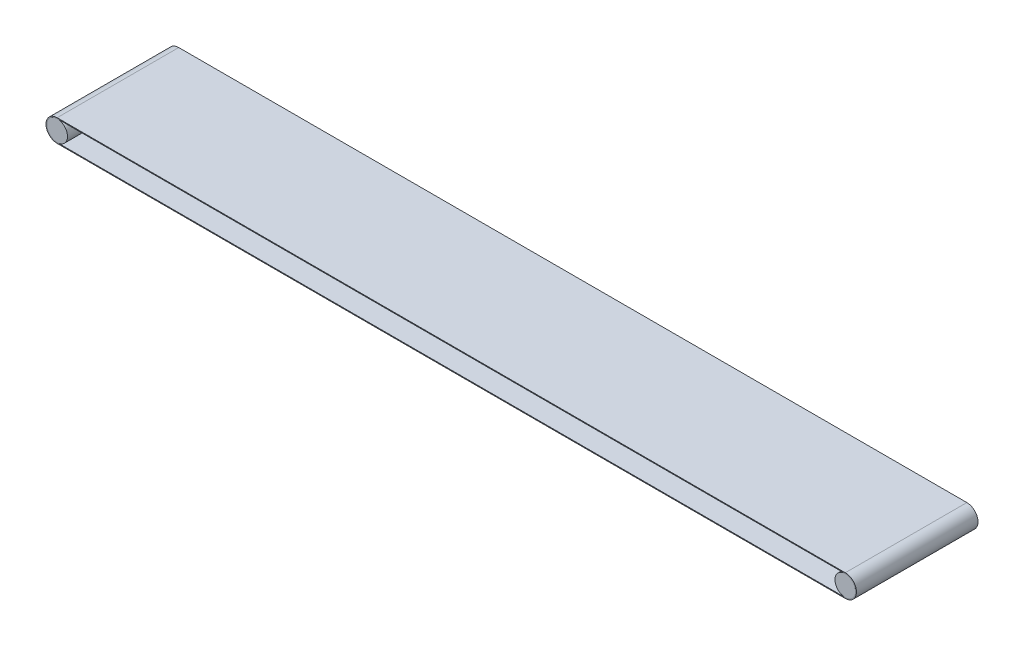
ISO-10303-21;
HEADER;
FILE_DESCRIPTION(('STEP AP214'),'2;1');
FILE_NAME('part.step','',(''),(''),'','','');
FILE_SCHEMA(('AUTOMOTIVE_DESIGN { 1 0 10303 214 1 1 1 1 }'));
ENDSEC;
DATA;
#1=APPLICATION_CONTEXT('core data for automotive mechanical design processes');
#2=APPLICATION_PROTOCOL_DEFINITION('international standard','automotive_design',2000,#1);
#3=PRODUCT_CONTEXT('',#1,'mechanical');
#4=PRODUCT('Part','Part','',(#3));
#5=PRODUCT_RELATED_PRODUCT_CATEGORY('part','',(#4));
#6=PRODUCT_DEFINITION_FORMATION('','',#4);
#7=PRODUCT_DEFINITION_CONTEXT('part definition',#1,'design');
#8=PRODUCT_DEFINITION('design','',#6,#7);
#9=PRODUCT_DEFINITION_SHAPE('','',#8);
#10=(LENGTH_UNIT() NAMED_UNIT(*) SI_UNIT(.MILLI.,.METRE.));
#11=(NAMED_UNIT(*) PLANE_ANGLE_UNIT() SI_UNIT($,.RADIAN.));
#12=(NAMED_UNIT(*) SI_UNIT($,.STERADIAN.) SOLID_ANGLE_UNIT());
#13=UNCERTAINTY_MEASURE_WITH_UNIT(LENGTH_MEASURE(1.E-05),#10,'distance_accuracy_value','');
#14=(GEOMETRIC_REPRESENTATION_CONTEXT(3) GLOBAL_UNCERTAINTY_ASSIGNED_CONTEXT((#13)) GLOBAL_UNIT_ASSIGNED_CONTEXT((#10,
#11,#12)) REPRESENTATION_CONTEXT('',''));
#15=CARTESIAN_POINT('',(0.,0.,0.));
#16=DIRECTION('',(0.,0.,1.));
#17=DIRECTION('',(1.,0.,0.));
#18=AXIS2_PLACEMENT_3D('',#15,#16,#17);
#19=CARTESIAN_POINT('',(-972.5,0.,-2000.75610707552));
#20=DIRECTION('',(0.,0.,1.));
#21=DIRECTION('',(1.,0.,0.));
#22=AXIS2_PLACEMENT_3D('',#19,#20,#21);
#23=CYLINDRICAL_SURFACE('',#22,27.5);
#24=DIRECTION('',(0.,0.,1.));
#25=VECTOR('',#24,1.);
#26=CARTESIAN_POINT('',(-972.5,27.5,-2000.75610707552));
#27=LINE('',#26,#25);
#28=CARTESIAN_POINT('',(-972.5,27.5,0.));
#29=VERTEX_POINT('',#28);
#30=CARTESIAN_POINT('',(-972.5,27.5,300.));
#31=VERTEX_POINT('',#30);
#32=EDGE_CURVE('E137',#29,#31,#27,.T.);
#33=ORIENTED_EDGE('',*,*,#32,.F.);
#34=CARTESIAN_POINT('',(-972.5,0.,0.));
#35=DIRECTION('',(0.,0.,-1.));
#36=DIRECTION('',(-1.,0.,0.));
#37=AXIS2_PLACEMENT_3D('',#34,#35,#36);
#38=CIRCLE('',#37,27.5);
#39=CARTESIAN_POINT('',(-972.5,-27.5,0.));
#40=VERTEX_POINT('',#39);
#41=EDGE_CURVE('E131',#29,#40,#38,.F.);
#42=ORIENTED_EDGE('',*,*,#41,.T.);
#43=DIRECTION('',(0.,0.,1.));
#44=VECTOR('',#43,1.);
#45=CARTESIAN_POINT('',(-972.5,-27.5,-2000.75610707552));
#46=LINE('',#45,#44);
#47=CARTESIAN_POINT('',(-972.5,-27.5,300.));
#48=VERTEX_POINT('',#47);
#49=EDGE_CURVE('E133',#40,#48,#46,.T.);
#50=ORIENTED_EDGE('',*,*,#49,.T.);
#51=CARTESIAN_POINT('',(-972.5,0.,300.));
#52=DIRECTION('',(0.,0.,1.));
#53=DIRECTION('',(1.,0.,0.));
#54=AXIS2_PLACEMENT_3D('',#51,#52,#53);
#55=CIRCLE('',#54,27.5);
#56=EDGE_CURVE('E159',#31,#48,#55,.T.);
#57=ORIENTED_EDGE('',*,*,#56,.F.);
#58=EDGE_LOOP('',(#33,#42,#50,#57));
#59=FACE_BOUND('',#58,.T.);
#60=ADVANCED_FACE('F43',(#59),#23,.T.);
#61=CARTESIAN_POINT('',(-972.5,27.5,-2000.75610707552));
#62=DIRECTION('',(0.,1.,0.));
#63=DIRECTION('',(0.,0.,1.));
#64=AXIS2_PLACEMENT_3D('',#61,#62,#63);
#65=PLANE('',#64);
#66=DIRECTION('',(0.,0.,1.));
#67=VECTOR('',#66,1.);
#68=CARTESIAN_POINT('',(972.5,27.5,-2000.75610707552));
#69=LINE('',#68,#67);
#70=CARTESIAN_POINT('',(972.5,27.5,0.));
#71=VERTEX_POINT('',#70);
#72=CARTESIAN_POINT('',(972.5,27.5,300.));
#73=VERTEX_POINT('',#72);
#74=EDGE_CURVE('E140',#71,#73,#69,.T.);
#75=ORIENTED_EDGE('',*,*,#74,.F.);
#76=DIRECTION('',(-1.,0.,0.));
#77=VECTOR('',#76,1.);
#78=CARTESIAN_POINT('',(-972.5,27.5,0.));
#79=LINE('',#78,#77);
#80=EDGE_CURVE('E134',#71,#29,#79,.T.);
#81=ORIENTED_EDGE('',*,*,#80,.T.);
#82=ORIENTED_EDGE('',*,*,#32,.T.);
#83=DIRECTION('',(-1.,0.,0.));
#84=VECTOR('',#83,1.);
#85=CARTESIAN_POINT('',(-972.5,27.5,300.));
#86=LINE('',#85,#84);
#87=EDGE_CURVE('E126',#73,#31,#86,.T.);
#88=ORIENTED_EDGE('',*,*,#87,.F.);
#89=EDGE_LOOP('',(#75,#81,#82,#88));
#90=FACE_BOUND('',#89,.T.);
#91=ADVANCED_FACE('F179',(#90),#65,.T.);
#92=CARTESIAN_POINT('',(972.5,0.,-2000.75610707552));
#93=DIRECTION('',(0.,0.,1.));
#94=DIRECTION('',(1.,0.,0.));
#95=AXIS2_PLACEMENT_3D('',#92,#93,#94);
#96=CYLINDRICAL_SURFACE('',#95,27.5);
#97=DIRECTION('',(0.,0.,1.));
#98=VECTOR('',#97,1.);
#99=CARTESIAN_POINT('',(972.5,-27.5,-2000.75610707552));
#100=LINE('',#99,#98);
#101=CARTESIAN_POINT('',(972.5,-27.5,0.));
#102=VERTEX_POINT('',#101);
#103=CARTESIAN_POINT('',(972.5,-27.5,300.));
#104=VERTEX_POINT('',#103);
#105=EDGE_CURVE('E144',#102,#104,#100,.T.);
#106=ORIENTED_EDGE('',*,*,#105,.F.);
#107=CARTESIAN_POINT('',(972.5,0.,0.));
#108=DIRECTION('',(0.,0.,-1.));
#109=DIRECTION('',(-1.,0.,0.));
#110=AXIS2_PLACEMENT_3D('',#107,#108,#109);
#111=CIRCLE('',#110,27.5);
#112=EDGE_CURVE('E138',#102,#71,#111,.F.);
#113=ORIENTED_EDGE('',*,*,#112,.T.);
#114=ORIENTED_EDGE('',*,*,#74,.T.);
#115=CARTESIAN_POINT('',(972.5,0.,300.));
#116=DIRECTION('',(0.,0.,1.));
#117=DIRECTION('',(-1.,0.,0.));
#118=AXIS2_PLACEMENT_3D('',#115,#116,#117);
#119=CIRCLE('',#118,27.5);
#120=EDGE_CURVE('E169',#104,#73,#119,.T.);
#121=ORIENTED_EDGE('',*,*,#120,.F.);
#122=EDGE_LOOP('',(#106,#113,#114,#121));
#123=FACE_BOUND('',#122,.T.);
#124=ADVANCED_FACE('F187',(#123),#96,.T.);
#125=CARTESIAN_POINT('',(-972.5,-27.5,-2000.75610707552));
#126=DIRECTION('',(0.,-1.,0.));
#127=DIRECTION('',(0.,0.,-1.));
#128=AXIS2_PLACEMENT_3D('',#125,#126,#127);
#129=PLANE('',#128);
#130=ORIENTED_EDGE('',*,*,#49,.F.);
#131=DIRECTION('',(1.,0.,0.));
#132=VECTOR('',#131,1.);
#133=CARTESIAN_POINT('',(-972.5,-27.5,0.));
#134=LINE('',#133,#132);
#135=EDGE_CURVE('E61',#40,#102,#134,.T.);
#136=ORIENTED_EDGE('',*,*,#135,.T.);
#137=ORIENTED_EDGE('',*,*,#105,.T.);
#138=DIRECTION('',(1.,0.,0.));
#139=VECTOR('',#138,1.);
#140=CARTESIAN_POINT('',(-972.5,-27.5,300.));
#141=LINE('',#140,#139);
#142=EDGE_CURVE('E164',#48,#104,#141,.T.);
#143=ORIENTED_EDGE('',*,*,#142,.F.);
#144=EDGE_LOOP('',(#130,#136,#137,#143));
#145=FACE_BOUND('',#144,.T.);
#146=ADVANCED_FACE('F184',(#145),#129,.T.);
#147=CARTESIAN_POINT('',(-972.5,0.,-2000.75610707552));
#148=DIRECTION('',(0.,0.,1.));
#149=DIRECTION('',(1.,0.,0.));
#150=AXIS2_PLACEMENT_3D('',#147,#148,#149);
#151=CYLINDRICAL_SURFACE('',#150,25.5);
#152=CARTESIAN_POINT('',(-972.5,0.,0.));
#153=DIRECTION('',(0.,0.,-1.));
#154=DIRECTION('',(-1.,0.,0.));
#155=AXIS2_PLACEMENT_3D('',#152,#153,#154);
#156=CIRCLE('',#155,25.5);
#157=CARTESIAN_POINT('',(-972.5,25.5,0.));
#158=VERTEX_POINT('',#157);
#159=CARTESIAN_POINT('',(-972.5,-25.5,0.));
#160=VERTEX_POINT('',#159);
#161=EDGE_CURVE('E107',#158,#160,#156,.F.);
#162=ORIENTED_EDGE('',*,*,#161,.F.);
#163=DIRECTION('',(0.,0.,1.));
#164=VECTOR('',#163,1.);
#165=CARTESIAN_POINT('',(-972.5,25.5,-2000.75610707552));
#166=LINE('',#165,#164);
#167=CARTESIAN_POINT('',(-972.5,25.5,300.));
#168=VERTEX_POINT('',#167);
#169=EDGE_CURVE('E146',#158,#168,#166,.T.);
#170=ORIENTED_EDGE('',*,*,#169,.T.);
#171=CARTESIAN_POINT('',(-972.5,0.,300.));
#172=DIRECTION('',(0.,0.,1.));
#173=DIRECTION('',(1.,0.,0.));
#174=AXIS2_PLACEMENT_3D('',#171,#172,#173);
#175=CIRCLE('',#174,25.5);
#176=CARTESIAN_POINT('',(-972.5,-25.5,300.));
#177=VERTEX_POINT('',#176);
#178=EDGE_CURVE('E110',#168,#177,#175,.T.);
#179=ORIENTED_EDGE('',*,*,#178,.T.);
#180=DIRECTION('',(0.,0.,1.));
#181=VECTOR('',#180,1.);
#182=CARTESIAN_POINT('',(-972.5,-25.5,-2000.75610707552));
#183=LINE('',#182,#181);
#184=EDGE_CURVE('E47',#160,#177,#183,.T.);
#185=ORIENTED_EDGE('',*,*,#184,.F.);
#186=EDGE_LOOP('',(#162,#170,#179,#185));
#187=FACE_BOUND('',#186,.T.);
#188=ADVANCED_FACE('F105',(#187),#151,.F.);
#189=CARTESIAN_POINT('',(-972.5,25.5,-2000.75610707552));
#190=DIRECTION('',(0.,1.,0.));
#191=DIRECTION('',(0.,0.,1.));
#192=AXIS2_PLACEMENT_3D('',#189,#190,#191);
#193=PLANE('',#192);
#194=DIRECTION('',(-1.,0.,0.));
#195=VECTOR('',#194,1.);
#196=CARTESIAN_POINT('',(-972.5,25.5,0.));
#197=LINE('',#196,#195);
#198=CARTESIAN_POINT('',(972.5,25.5,0.));
#199=VERTEX_POINT('',#198);
#200=EDGE_CURVE('E124',#199,#158,#197,.T.);
#201=ORIENTED_EDGE('',*,*,#200,.F.);
#202=DIRECTION('',(0.,0.,1.));
#203=VECTOR('',#202,1.);
#204=CARTESIAN_POINT('',(972.5,25.5,-2000.75610707552));
#205=LINE('',#204,#203);
#206=CARTESIAN_POINT('',(972.5,25.5,300.));
#207=VERTEX_POINT('',#206);
#208=EDGE_CURVE('E149',#199,#207,#205,.T.);
#209=ORIENTED_EDGE('',*,*,#208,.T.);
#210=DIRECTION('',(-1.,0.,0.));
#211=VECTOR('',#210,1.);
#212=CARTESIAN_POINT('',(-972.5,25.5,300.));
#213=LINE('',#212,#211);
#214=EDGE_CURVE('E150',#207,#168,#213,.T.);
#215=ORIENTED_EDGE('',*,*,#214,.T.);
#216=ORIENTED_EDGE('',*,*,#169,.F.);
#217=EDGE_LOOP('',(#201,#209,#215,#216));
#218=FACE_BOUND('',#217,.T.);
#219=ADVANCED_FACE('F207',(#218),#193,.F.);
#220=CARTESIAN_POINT('',(972.5,0.,-2000.75610707552));
#221=DIRECTION('',(0.,0.,1.));
#222=DIRECTION('',(1.,0.,0.));
#223=AXIS2_PLACEMENT_3D('',#220,#221,#222);
#224=CYLINDRICAL_SURFACE('',#223,25.5);
#225=CARTESIAN_POINT('',(972.5,0.,0.));
#226=DIRECTION('',(0.,0.,-1.));
#227=DIRECTION('',(-1.,0.,0.));
#228=AXIS2_PLACEMENT_3D('',#225,#226,#227);
#229=CIRCLE('',#228,25.5);
#230=CARTESIAN_POINT('',(972.5,-25.5,0.));
#231=VERTEX_POINT('',#230);
#232=EDGE_CURVE('E12',#231,#199,#229,.F.);
#233=ORIENTED_EDGE('',*,*,#232,.F.);
#234=DIRECTION('',(0.,0.,1.));
#235=VECTOR('',#234,1.);
#236=CARTESIAN_POINT('',(972.5,-25.5,-2000.75610707552));
#237=LINE('',#236,#235);
#238=CARTESIAN_POINT('',(972.5,-25.5,300.));
#239=VERTEX_POINT('',#238);
#240=EDGE_CURVE('E119',#231,#239,#237,.T.);
#241=ORIENTED_EDGE('',*,*,#240,.T.);
#242=CARTESIAN_POINT('',(972.5,0.,300.));
#243=DIRECTION('',(0.,0.,1.));
#244=DIRECTION('',(-1.,0.,0.));
#245=AXIS2_PLACEMENT_3D('',#242,#243,#244);
#246=CIRCLE('',#245,25.5);
#247=EDGE_CURVE('E115',#239,#207,#246,.T.);
#248=ORIENTED_EDGE('',*,*,#247,.T.);
#249=ORIENTED_EDGE('',*,*,#208,.F.);
#250=EDGE_LOOP('',(#233,#241,#248,#249));
#251=FACE_BOUND('',#250,.T.);
#252=ADVANCED_FACE('F204',(#251),#224,.F.);
#253=CARTESIAN_POINT('',(-972.5,-25.5,-2000.75610707552));
#254=DIRECTION('',(0.,-1.,0.));
#255=DIRECTION('',(0.,0.,-1.));
#256=AXIS2_PLACEMENT_3D('',#253,#254,#255);
#257=PLANE('',#256);
#258=DIRECTION('',(1.,0.,0.));
#259=VECTOR('',#258,1.);
#260=CARTESIAN_POINT('',(-972.5,-25.5,0.));
#261=LINE('',#260,#259);
#262=EDGE_CURVE('E53',#160,#231,#261,.T.);
#263=ORIENTED_EDGE('',*,*,#262,.F.);
#264=ORIENTED_EDGE('',*,*,#184,.T.);
#265=DIRECTION('',(1.,0.,0.));
#266=VECTOR('',#265,1.);
#267=CARTESIAN_POINT('',(-972.5,-25.5,300.));
#268=LINE('',#267,#266);
#269=EDGE_CURVE('E114',#177,#239,#268,.T.);
#270=ORIENTED_EDGE('',*,*,#269,.T.);
#271=ORIENTED_EDGE('',*,*,#240,.F.);
#272=EDGE_LOOP('',(#263,#264,#270,#271));
#273=FACE_BOUND('',#272,.T.);
#274=ADVANCED_FACE('F118',(#273),#257,.F.);
#275=CARTESIAN_POINT('',(-972.5,0.,300.));
#276=DIRECTION('',(0.,0.,1.));
#277=DIRECTION('',(1.,0.,0.));
#278=AXIS2_PLACEMENT_3D('',#275,#276,#277);
#279=PLANE('',#278);
#280=ORIENTED_EDGE('',*,*,#178,.F.);
#281=ORIENTED_EDGE('',*,*,#214,.F.);
#282=ORIENTED_EDGE('',*,*,#247,.F.);
#283=ORIENTED_EDGE('',*,*,#269,.F.);
#284=EDGE_LOOP('',(#280,#281,#282,#283));
#285=FACE_BOUND('',#284,.T.);
#286=ORIENTED_EDGE('',*,*,#56,.T.);
#287=ORIENTED_EDGE('',*,*,#142,.T.);
#288=ORIENTED_EDGE('',*,*,#120,.T.);
#289=ORIENTED_EDGE('',*,*,#87,.T.);
#290=EDGE_LOOP('',(#286,#287,#288,#289));
#291=FACE_BOUND('',#290,.T.);
#292=ADVANCED_FACE('F175',(#285,#291),#279,.T.);
#293=CARTESIAN_POINT('',(972.5,0.,0.));
#294=DIRECTION('',(0.,0.,-1.));
#295=DIRECTION('',(-1.,0.,0.));
#296=AXIS2_PLACEMENT_3D('',#293,#294,#295);
#297=PLANE('',#296);
#298=ORIENTED_EDGE('',*,*,#41,.F.);
#299=ORIENTED_EDGE('',*,*,#80,.F.);
#300=ORIENTED_EDGE('',*,*,#112,.F.);
#301=ORIENTED_EDGE('',*,*,#135,.F.);
#302=EDGE_LOOP('',(#298,#299,#300,#301));
#303=FACE_BOUND('',#302,.T.);
#304=ORIENTED_EDGE('',*,*,#200,.T.);
#305=ORIENTED_EDGE('',*,*,#161,.T.);
#306=ORIENTED_EDGE('',*,*,#262,.T.);
#307=ORIENTED_EDGE('',*,*,#232,.T.);
#308=EDGE_LOOP('',(#304,#305,#306,#307));
#309=FACE_BOUND('',#308,.T.);
#310=ADVANCED_FACE('F45',(#303,#309),#297,.T.);
#311=CLOSED_SHELL('',(#60,#91,#124,#146,#188,#219,#252,#274,#292,#310));
#312=MANIFOLD_SOLID_BREP('B2',#311);
#313=CARTESIAN_POINT('',(972.5,0.,300.));
#314=DIRECTION('',(0.,0.,-1.));
#315=DIRECTION('',(-1.,0.,0.));
#316=AXIS2_PLACEMENT_3D('',#313,#314,#315);
#317=CYLINDRICAL_SURFACE('',#316,25.5);
#318=CARTESIAN_POINT('',(972.5,0.,300.));
#319=DIRECTION('',(0.,0.,1.));
#320=DIRECTION('',(-1.,0.,0.));
#321=AXIS2_PLACEMENT_3D('',#318,#319,#320);
#322=CIRCLE('',#321,25.5);
#323=CARTESIAN_POINT('',(947.,0.,300.));
#324=VERTEX_POINT('',#323);
#325=EDGE_CURVE('E42',#324,#324,#322,.T.);
#326=ORIENTED_EDGE('',*,*,#325,.F.);
#327=EDGE_LOOP('',(#326));
#328=FACE_BOUND('',#327,.T.);
#329=CARTESIAN_POINT('',(972.5,0.,0.));
#330=DIRECTION('',(0.,0.,1.));
#331=DIRECTION('',(-1.,0.,0.));
#332=AXIS2_PLACEMENT_3D('',#329,#330,#331);
#333=CIRCLE('',#332,25.5);
#334=CARTESIAN_POINT('',(947.,0.,0.));
#335=VERTEX_POINT('',#334);
#336=EDGE_CURVE('E294',#335,#335,#333,.T.);
#337=ORIENTED_EDGE('',*,*,#336,.T.);
#338=EDGE_LOOP('',(#337));
#339=FACE_BOUND('',#338,.T.);
#340=ADVANCED_FACE('F291',(#328,#339),#317,.T.);
#341=CARTESIAN_POINT('',(972.5,0.,300.));
#342=DIRECTION('',(0.,0.,-1.));
#343=DIRECTION('',(-1.,0.,0.));
#344=AXIS2_PLACEMENT_3D('',#341,#342,#343);
#345=PLANE('',#344);
#346=ORIENTED_EDGE('',*,*,#325,.T.);
#347=EDGE_LOOP('',(#346));
#348=FACE_BOUND('',#347,.T.);
#349=ADVANCED_FACE('F306',(#348),#345,.F.);
#350=CARTESIAN_POINT('',(972.5,0.,0.));
#351=DIRECTION('',(0.,0.,-1.));
#352=DIRECTION('',(-1.,0.,0.));
#353=AXIS2_PLACEMENT_3D('',#350,#351,#352);
#354=PLANE('',#353);
#355=ORIENTED_EDGE('',*,*,#336,.F.);
#356=EDGE_LOOP('',(#355));
#357=FACE_BOUND('',#356,.T.);
#358=ADVANCED_FACE('F304',(#357),#354,.T.);
#359=CLOSED_SHELL('',(#340,#349,#358));
#360=MANIFOLD_SOLID_BREP('B6',#359);
#361=CARTESIAN_POINT('',(-972.5,0.,300.));
#362=DIRECTION('',(0.,0.,-1.));
#363=DIRECTION('',(-1.,0.,0.));
#364=AXIS2_PLACEMENT_3D('',#361,#362,#363);
#365=CYLINDRICAL_SURFACE('',#364,25.4999999999999);
#366=CARTESIAN_POINT('',(-972.5,0.,300.));
#367=DIRECTION('',(0.,0.,1.));
#368=DIRECTION('',(1.,0.,0.));
#369=AXIS2_PLACEMENT_3D('',#366,#367,#368);
#370=CIRCLE('',#369,25.4999999999999);
#371=CARTESIAN_POINT('',(-947.,0.,300.));
#372=VERTEX_POINT('',#371);
#373=EDGE_CURVE('E290',#372,#372,#370,.T.);
#374=ORIENTED_EDGE('',*,*,#373,.F.);
#375=EDGE_LOOP('',(#374));
#376=FACE_BOUND('',#375,.T.);
#377=CARTESIAN_POINT('',(-972.5,0.,0.));
#378=DIRECTION('',(0.,0.,1.));
#379=DIRECTION('',(1.,0.,0.));
#380=AXIS2_PLACEMENT_3D('',#377,#378,#379);
#381=CIRCLE('',#380,25.4999999999999);
#382=CARTESIAN_POINT('',(-947.,0.,0.));
#383=VERTEX_POINT('',#382);
#384=EDGE_CURVE('E334',#383,#383,#381,.T.);
#385=ORIENTED_EDGE('',*,*,#384,.T.);
#386=EDGE_LOOP('',(#385));
#387=FACE_BOUND('',#386,.T.);
#388=ADVANCED_FACE('F331',(#376,#387),#365,.T.);
#389=CARTESIAN_POINT('',(-972.5,0.,300.));
#390=DIRECTION('',(0.,0.,1.));
#391=DIRECTION('',(1.,0.,0.));
#392=AXIS2_PLACEMENT_3D('',#389,#390,#391);
#393=PLANE('',#392);
#394=ORIENTED_EDGE('',*,*,#373,.T.);
#395=EDGE_LOOP('',(#394));
#396=FACE_BOUND('',#395,.T.);
#397=ADVANCED_FACE('F346',(#396),#393,.T.);
#398=CARTESIAN_POINT('',(-972.5,0.,0.));
#399=DIRECTION('',(0.,0.,1.));
#400=DIRECTION('',(1.,0.,0.));
#401=AXIS2_PLACEMENT_3D('',#398,#399,#400);
#402=PLANE('',#401);
#403=ORIENTED_EDGE('',*,*,#384,.F.);
#404=EDGE_LOOP('',(#403));
#405=FACE_BOUND('',#404,.T.);
#406=ADVANCED_FACE('F344',(#405),#402,.F.);
#407=CLOSED_SHELL('',(#388,#397,#406));
#408=MANIFOLD_SOLID_BREP('B37',#407);
#409=ADVANCED_BREP_SHAPE_REPRESENTATION('',(#18,#312,#360,#408),#14);
#410=SHAPE_DEFINITION_REPRESENTATION(#9,#409);
ENDSEC;
END-ISO-10303-21;
